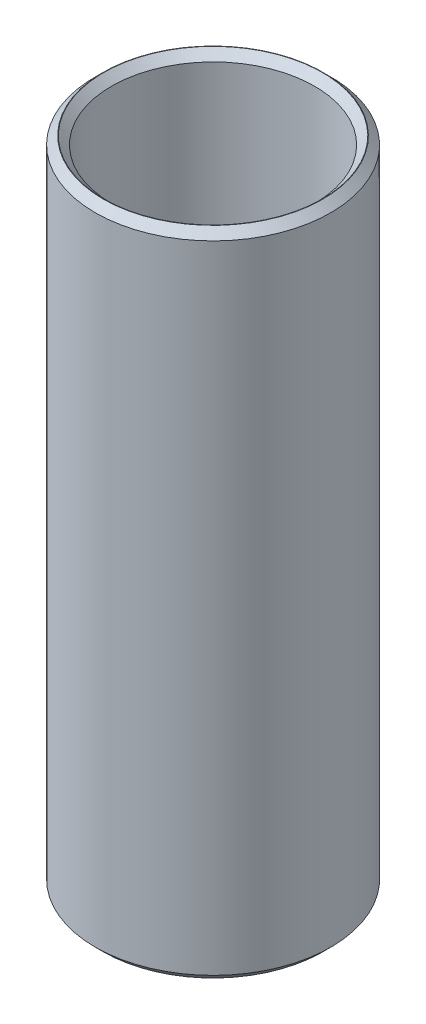
ISO-10303-21;
HEADER;
FILE_DESCRIPTION(('STEP AP214'),'2;1');
FILE_NAME('part.step','',(''),(''),'','','');
FILE_SCHEMA(('AUTOMOTIVE_DESIGN { 1 0 10303 214 1 1 1 1 }'));
ENDSEC;
DATA;
#1=APPLICATION_CONTEXT('core data for automotive mechanical design processes');
#2=APPLICATION_PROTOCOL_DEFINITION('international standard','automotive_design',2000,#1);
#3=PRODUCT_CONTEXT('',#1,'mechanical');
#4=PRODUCT('Part','Part','',(#3));
#5=PRODUCT_RELATED_PRODUCT_CATEGORY('part','',(#4));
#6=PRODUCT_DEFINITION_FORMATION('','',#4);
#7=PRODUCT_DEFINITION_CONTEXT('part definition',#1,'design');
#8=PRODUCT_DEFINITION('design','',#6,#7);
#9=PRODUCT_DEFINITION_SHAPE('','',#8);
#10=(LENGTH_UNIT() NAMED_UNIT(*) SI_UNIT(.MILLI.,.METRE.));
#11=(NAMED_UNIT(*) PLANE_ANGLE_UNIT() SI_UNIT($,.RADIAN.));
#12=(NAMED_UNIT(*) SI_UNIT($,.STERADIAN.) SOLID_ANGLE_UNIT());
#13=UNCERTAINTY_MEASURE_WITH_UNIT(LENGTH_MEASURE(1.E-05),#10,'distance_accuracy_value','');
#14=(GEOMETRIC_REPRESENTATION_CONTEXT(3) GLOBAL_UNCERTAINTY_ASSIGNED_CONTEXT((#13)) GLOBAL_UNIT_ASSIGNED_CONTEXT((#10,
#11,#12)) REPRESENTATION_CONTEXT('',''));
#15=CARTESIAN_POINT('',(0.,0.,0.));
#16=DIRECTION('',(0.,0.,1.));
#17=DIRECTION('',(1.,0.,0.));
#18=AXIS2_PLACEMENT_3D('',#15,#16,#17);
#19=CARTESIAN_POINT('',(0.,207.606304187957,0.));
#20=DIRECTION('',(0.,-1.,0.));
#21=DIRECTION('',(0.,0.,-1.));
#22=AXIS2_PLACEMENT_3D('',#19,#20,#21);
#23=CYLINDRICAL_SURFACE('',#22,37.5);
#24=CARTESIAN_POINT('',(0.,2.51328974048198,0.));
#25=DIRECTION('',(0.,1.,0.));
#26=DIRECTION('',(0.,0.,1.));
#27=AXIS2_PLACEMENT_3D('',#24,#25,#26);
#28=CIRCLE('',#27,37.5);
#29=CARTESIAN_POINT('',(0.,2.51328974048198,37.5));
#30=VERTEX_POINT('',#29);
#31=EDGE_CURVE('E10',#30,#30,#28,.T.);
#32=ORIENTED_EDGE('',*,*,#31,.T.);
#33=EDGE_LOOP('',(#32));
#34=FACE_BOUND('',#33,.T.);
#35=CARTESIAN_POINT('',(0.,205.093014447475,0.));
#36=DIRECTION('',(0.,1.,0.));
#37=DIRECTION('',(0.,0.,1.));
#38=AXIS2_PLACEMENT_3D('',#35,#36,#37);
#39=CIRCLE('',#38,37.5);
#40=CARTESIAN_POINT('',(0.,205.093014447475,37.5));
#41=VERTEX_POINT('',#40);
#42=EDGE_CURVE('E50',#41,#41,#39,.F.);
#43=ORIENTED_EDGE('',*,*,#42,.T.);
#44=EDGE_LOOP('',(#43));
#45=FACE_BOUND('',#44,.T.);
#46=ADVANCED_FACE('F39',(#34,#45),#23,.T.);
#47=CARTESIAN_POINT('',(0.,207.606304187957,0.));
#48=DIRECTION('',(0.,1.,0.));
#49=DIRECTION('',(0.,0.,1.));
#50=AXIS2_PLACEMENT_3D('',#47,#48,#49);
#51=PLANE('',#50);
#52=CARTESIAN_POINT('',(0.,207.606304187957,0.));
#53=DIRECTION('',(0.,1.,0.));
#54=DIRECTION('',(0.,0.,1.));
#55=AXIS2_PLACEMENT_3D('',#52,#53,#54);
#56=CIRCLE('',#55,34.8529598979196);
#57=CARTESIAN_POINT('',(0.,207.606304187957,34.8529598979196));
#58=VERTEX_POINT('',#57);
#59=EDGE_CURVE('E58',#58,#58,#56,.F.);
#60=ORIENTED_EDGE('',*,*,#59,.T.);
#61=EDGE_LOOP('',(#60));
#62=FACE_BOUND('',#61,.T.);
#63=CARTESIAN_POINT('',(0.,207.606304187957,0.));
#64=DIRECTION('',(0.,1.,0.));
#65=DIRECTION('',(0.,0.,1.));
#66=AXIS2_PLACEMENT_3D('',#63,#64,#65);
#67=CIRCLE('',#66,34.986710259518);
#68=CARTESIAN_POINT('',(0.,207.606304187957,34.986710259518));
#69=VERTEX_POINT('',#68);
#70=EDGE_CURVE('E61',#69,#69,#67,.T.);
#71=ORIENTED_EDGE('',*,*,#70,.T.);
#72=EDGE_LOOP('',(#71));
#73=FACE_BOUND('',#72,.T.);
#74=ADVANCED_FACE('F88',(#62,#73),#51,.T.);
#75=CARTESIAN_POINT('',(0.,0.,0.));
#76=DIRECTION('',(0.,1.,0.));
#77=DIRECTION('',(0.,0.,1.));
#78=AXIS2_PLACEMENT_3D('',#75,#76,#77);
#79=PLANE('',#78);
#80=CARTESIAN_POINT('',(0.,0.,0.));
#81=DIRECTION('',(0.,1.,0.));
#82=DIRECTION('',(0.,0.,1.));
#83=AXIS2_PLACEMENT_3D('',#80,#81,#82);
#84=CIRCLE('',#83,34.8529598979196);
#85=CARTESIAN_POINT('',(0.,0.,34.8529598979196));
#86=VERTEX_POINT('',#85);
#87=EDGE_CURVE('E51',#86,#86,#84,.T.);
#88=ORIENTED_EDGE('',*,*,#87,.T.);
#89=EDGE_LOOP('',(#88));
#90=FACE_BOUND('',#89,.T.);
#91=CARTESIAN_POINT('',(0.,0.,0.));
#92=DIRECTION('',(0.,1.,0.));
#93=DIRECTION('',(0.,0.,1.));
#94=AXIS2_PLACEMENT_3D('',#91,#92,#93);
#95=CIRCLE('',#94,34.986710259518);
#96=CARTESIAN_POINT('',(0.,0.,34.986710259518));
#97=VERTEX_POINT('',#96);
#98=EDGE_CURVE('E54',#97,#97,#95,.F.);
#99=ORIENTED_EDGE('',*,*,#98,.T.);
#100=EDGE_LOOP('',(#99));
#101=FACE_BOUND('',#100,.T.);
#102=ADVANCED_FACE('F83',(#90,#101),#79,.F.);
#103=CARTESIAN_POINT('',(0.,207.606304187957,0.));
#104=DIRECTION('',(0.,-1.,0.));
#105=DIRECTION('',(0.,0.,-1.));
#106=AXIS2_PLACEMENT_3D('',#103,#104,#105);
#107=CYLINDRICAL_SURFACE('',#106,32.3396701574376);
#108=CARTESIAN_POINT('',(0.,205.093014447475,0.));
#109=DIRECTION('',(0.,1.,0.));
#110=DIRECTION('',(0.,0.,1.));
#111=AXIS2_PLACEMENT_3D('',#108,#109,#110);
#112=CIRCLE('',#111,32.3396701574376);
#113=CARTESIAN_POINT('',(0.,205.093014447475,32.3396701574376));
#114=VERTEX_POINT('',#113);
#115=EDGE_CURVE('E67',#114,#114,#112,.T.);
#116=ORIENTED_EDGE('',*,*,#115,.T.);
#117=EDGE_LOOP('',(#116));
#118=FACE_BOUND('',#117,.T.);
#119=CARTESIAN_POINT('',(0.,2.51328974048204,0.));
#120=DIRECTION('',(0.,1.,0.));
#121=DIRECTION('',(0.,0.,1.));
#122=AXIS2_PLACEMENT_3D('',#119,#120,#121);
#123=CIRCLE('',#122,32.3396701574376);
#124=CARTESIAN_POINT('',(0.,2.51328974048204,32.3396701574376));
#125=VERTEX_POINT('',#124);
#126=EDGE_CURVE('E69',#125,#125,#123,.F.);
#127=ORIENTED_EDGE('',*,*,#126,.T.);
#128=EDGE_LOOP('',(#127));
#129=FACE_BOUND('',#128,.T.);
#130=ADVANCED_FACE('F71',(#118,#129),#107,.F.);
#131=CARTESIAN_POINT('',(0.,205.093014447475,0.));
#132=DIRECTION('',(0.,1.,0.));
#133=DIRECTION('',(0.,0.,1.));
#134=AXIS2_PLACEMENT_3D('',#131,#132,#133);
#135=CONICAL_SURFACE('',#134,32.3396701574376,0.785398163397447);
#136=ORIENTED_EDGE('',*,*,#59,.F.);
#137=EDGE_LOOP('',(#136));
#138=FACE_BOUND('',#137,.T.);
#139=ORIENTED_EDGE('',*,*,#115,.F.);
#140=EDGE_LOOP('',(#139));
#141=FACE_BOUND('',#140,.T.);
#142=ADVANCED_FACE('F77',(#138,#141),#135,.F.);
#143=CARTESIAN_POINT('',(0.,0.,0.));
#144=DIRECTION('',(0.,-1.,0.));
#145=DIRECTION('',(0.,0.,-1.));
#146=AXIS2_PLACEMENT_3D('',#143,#144,#145);
#147=CONICAL_SURFACE('',#146,34.8529598979196,0.785398163397447);
#148=ORIENTED_EDGE('',*,*,#126,.F.);
#149=EDGE_LOOP('',(#148));
#150=FACE_BOUND('',#149,.T.);
#151=ORIENTED_EDGE('',*,*,#87,.F.);
#152=EDGE_LOOP('',(#151));
#153=FACE_BOUND('',#152,.T.);
#154=ADVANCED_FACE('F73',(#150,#153),#147,.F.);
#155=CARTESIAN_POINT('',(0.,2.51328974048198,0.));
#156=DIRECTION('',(0.,1.,0.));
#157=DIRECTION('',(0.,0.,1.));
#158=AXIS2_PLACEMENT_3D('',#155,#156,#157);
#159=CONICAL_SURFACE('',#158,37.5,0.785398163397454);
#160=ORIENTED_EDGE('',*,*,#98,.F.);
#161=EDGE_LOOP('',(#160));
#162=FACE_BOUND('',#161,.T.);
#163=ORIENTED_EDGE('',*,*,#31,.F.);
#164=EDGE_LOOP('',(#163));
#165=FACE_BOUND('',#164,.T.);
#166=ADVANCED_FACE('F76',(#162,#165),#159,.T.);
#167=CARTESIAN_POINT('',(0.,207.606304187957,0.));
#168=DIRECTION('',(0.,-1.,0.));
#169=DIRECTION('',(0.,0.,-1.));
#170=AXIS2_PLACEMENT_3D('',#167,#168,#169);
#171=CONICAL_SURFACE('',#170,34.986710259518,0.785398163397454);
#172=ORIENTED_EDGE('',*,*,#42,.F.);
#173=EDGE_LOOP('',(#172));
#174=FACE_BOUND('',#173,.T.);
#175=ORIENTED_EDGE('',*,*,#70,.F.);
#176=EDGE_LOOP('',(#175));
#177=FACE_BOUND('',#176,.T.);
#178=ADVANCED_FACE('F45',(#174,#177),#171,.T.);
#179=CLOSED_SHELL('',(#46,#74,#102,#130,#142,#154,#166,#178));
#180=MANIFOLD_SOLID_BREP('B2',#179);
#181=ADVANCED_BREP_SHAPE_REPRESENTATION('',(#18,#180),#14);
#182=SHAPE_DEFINITION_REPRESENTATION(#9,#181);
ENDSEC;
END-ISO-10303-21;
